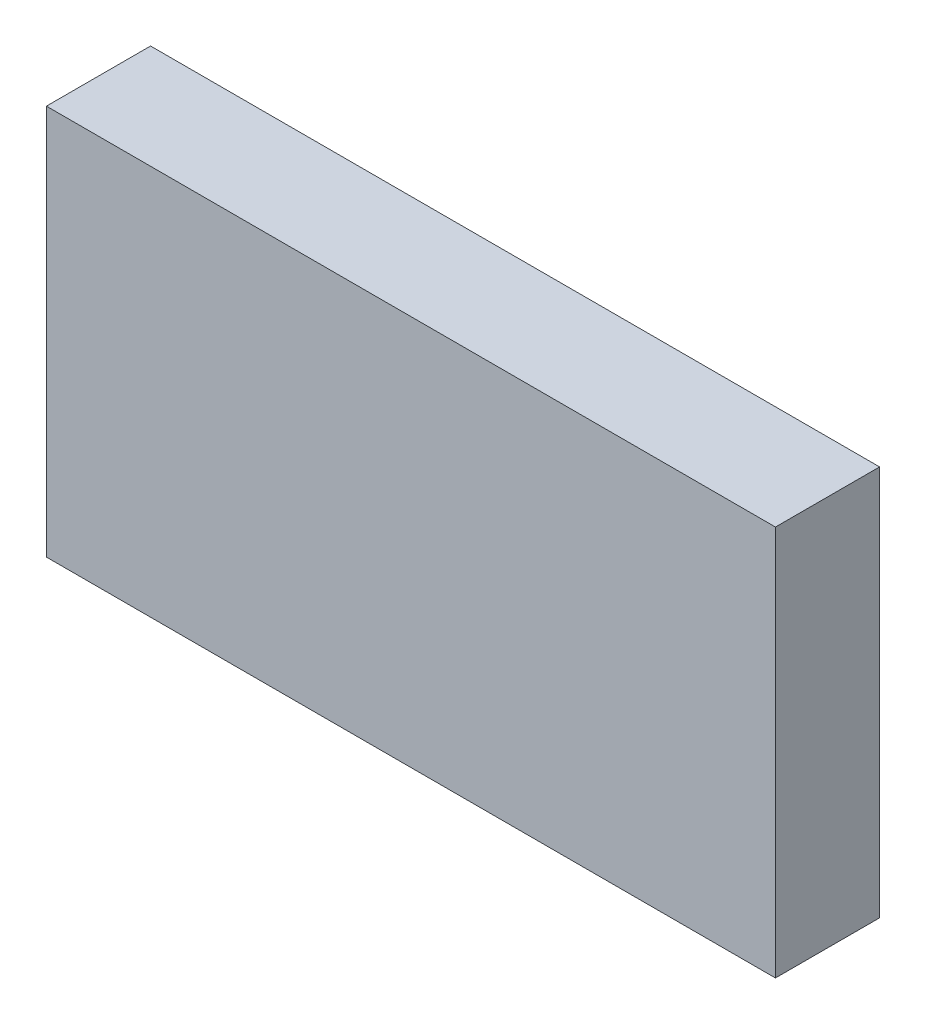
ISO-10303-21;
HEADER;
FILE_DESCRIPTION(('STEP AP214'),'2;1');
FILE_NAME('part.step','',(''),(''),'','','');
FILE_SCHEMA(('AUTOMOTIVE_DESIGN { 1 0 10303 214 1 1 1 1 }'));
ENDSEC;
DATA;
#1=APPLICATION_CONTEXT('core data for automotive mechanical design processes');
#2=APPLICATION_PROTOCOL_DEFINITION('international standard','automotive_design',2000,#1);
#3=PRODUCT_CONTEXT('',#1,'mechanical');
#4=PRODUCT('Part','Part','',(#3));
#5=PRODUCT_RELATED_PRODUCT_CATEGORY('part','',(#4));
#6=PRODUCT_DEFINITION_FORMATION('','',#4);
#7=PRODUCT_DEFINITION_CONTEXT('part definition',#1,'design');
#8=PRODUCT_DEFINITION('design','',#6,#7);
#9=PRODUCT_DEFINITION_SHAPE('','',#8);
#10=(LENGTH_UNIT() NAMED_UNIT(*) SI_UNIT(.MILLI.,.METRE.));
#11=(NAMED_UNIT(*) PLANE_ANGLE_UNIT() SI_UNIT($,.RADIAN.));
#12=(NAMED_UNIT(*) SI_UNIT($,.STERADIAN.) SOLID_ANGLE_UNIT());
#13=UNCERTAINTY_MEASURE_WITH_UNIT(LENGTH_MEASURE(1.E-05),#10,'distance_accuracy_value','');
#14=(GEOMETRIC_REPRESENTATION_CONTEXT(3) GLOBAL_UNCERTAINTY_ASSIGNED_CONTEXT((#13)) GLOBAL_UNIT_ASSIGNED_CONTEXT((#10,
#11,#12)) REPRESENTATION_CONTEXT('',''));
#15=CARTESIAN_POINT('',(0.,0.,0.));
#16=DIRECTION('',(0.,0.,1.));
#17=DIRECTION('',(1.,0.,0.));
#18=AXIS2_PLACEMENT_3D('',#15,#16,#17);
#19=CARTESIAN_POINT('',(0.104909158135323,-0.738316509343394,0.0826433070866142));
#20=DIRECTION('',(0.,0.,-1.));
#21=DIRECTION('',(0.,1.,0.));
#22=AXIS2_PLACEMENT_3D('',#19,#20,#21);
#23=PLANE('',#22);
#24=DIRECTION('',(0.,1.,0.));
#25=VECTOR('',#24,1.);
#26=CARTESIAN_POINT('',(0.108436717190441,-0.738316509343394,0.0826433070866142));
#27=LINE('',#26,#25);
#28=CARTESIAN_POINT('',(0.108436717190441,-0.698631469973316,0.0826433070866142));
#29=VERTEX_POINT('',#28);
#30=CARTESIAN_POINT('',(0.108436717190441,-0.736426745563867,0.0826433070866142));
#31=VERTEX_POINT('',#30);
#32=EDGE_CURVE('E71',#29,#31,#27,.F.);
#33=ORIENTED_EDGE('',*,*,#32,.T.);
#34=DIRECTION('',(1.,0.,0.));
#35=VECTOR('',#34,1.);
#36=CARTESIAN_POINT('',(0.182515457347921,-0.736426745563867,0.0826433070866142));
#37=LINE('',#36,#35);
#38=CARTESIAN_POINT('',(0.178987898292803,-0.736426745563867,0.0826433070866142));
#39=VERTEX_POINT('',#38);
#40=EDGE_CURVE('E54',#39,#31,#37,.F.);
#41=ORIENTED_EDGE('',*,*,#40,.F.);
#42=DIRECTION('',(0.,1.,0.));
#43=VECTOR('',#42,1.);
#44=CARTESIAN_POINT('',(0.178987898292803,-0.738316509343394,0.0826433070866142));
#45=LINE('',#44,#43);
#46=CARTESIAN_POINT('',(0.178987898292803,-0.698631469973316,0.0826433070866142));
#47=VERTEX_POINT('',#46);
#48=EDGE_CURVE('E20',#47,#39,#45,.F.);
#49=ORIENTED_EDGE('',*,*,#48,.F.);
#50=DIRECTION('',(1.,0.,0.));
#51=VECTOR('',#50,1.);
#52=CARTESIAN_POINT('',(0.182515457347921,-0.698631469973316,0.0826433070866142));
#53=LINE('',#52,#51);
#54=EDGE_CURVE('E81',#29,#47,#53,.T.);
#55=ORIENTED_EDGE('',*,*,#54,.F.);
#56=EDGE_LOOP('',(#33,#41,#49,#55));
#57=FACE_BOUND('',#56,.T.);
#58=ADVANCED_FACE('F17',(#57),#23,.F.);
#59=CARTESIAN_POINT('',(0.178987898292803,-0.738316509343394,0.0720606299212598));
#60=DIRECTION('',(-1.,0.,0.));
#61=DIRECTION('',(0.,0.,1.));
#62=AXIS2_PLACEMENT_3D('',#59,#60,#61);
#63=PLANE('',#62);
#64=DIRECTION('',(0.,0.,-1.));
#65=VECTOR('',#64,1.);
#66=CARTESIAN_POINT('',(0.178987898292803,-0.698631469973316,0.0831472440944882));
#67=LINE('',#66,#65);
#68=CARTESIAN_POINT('',(0.178987898292803,-0.698631469973316,0.0725645669291339));
#69=VERTEX_POINT('',#68);
#70=EDGE_CURVE('E64',#47,#69,#67,.T.);
#71=ORIENTED_EDGE('',*,*,#70,.F.);
#72=ORIENTED_EDGE('',*,*,#48,.T.);
#73=DIRECTION('',(0.,0.,1.));
#74=VECTOR('',#73,1.);
#75=CARTESIAN_POINT('',(0.178987898292803,-0.736426745563867,0.0720606299212598));
#76=LINE('',#75,#74);
#77=CARTESIAN_POINT('',(0.178987898292803,-0.736426745563867,0.0725645669291339));
#78=VERTEX_POINT('',#77);
#79=EDGE_CURVE('E62',#78,#39,#76,.T.);
#80=ORIENTED_EDGE('',*,*,#79,.F.);
#81=DIRECTION('',(0.,-1.,0.));
#82=VECTOR('',#81,1.);
#83=CARTESIAN_POINT('',(0.178987898292803,-0.738316509343394,0.0725645669291339));
#84=LINE('',#83,#82);
#85=EDGE_CURVE('E83',#69,#78,#84,.T.);
#86=ORIENTED_EDGE('',*,*,#85,.F.);
#87=EDGE_LOOP('',(#71,#72,#80,#86));
#88=FACE_BOUND('',#87,.T.);
#89=ADVANCED_FACE('F60',(#88),#63,.F.);
#90=CARTESIAN_POINT('',(0.182515457347921,-0.736426745563867,0.0720606299212598));
#91=DIRECTION('',(0.,1.,0.));
#92=DIRECTION('',(0.,0.,1.));
#93=AXIS2_PLACEMENT_3D('',#90,#91,#92);
#94=PLANE('',#93);
#95=DIRECTION('',(0.,0.,1.));
#96=VECTOR('',#95,1.);
#97=CARTESIAN_POINT('',(0.108436717190441,-0.736426745563867,0.0720606299212598));
#98=LINE('',#97,#96);
#99=CARTESIAN_POINT('',(0.108436717190441,-0.736426745563867,0.0725645669291339));
#100=VERTEX_POINT('',#99);
#101=EDGE_CURVE('E73',#31,#100,#98,.F.);
#102=ORIENTED_EDGE('',*,*,#101,.T.);
#103=DIRECTION('',(1.,0.,0.));
#104=VECTOR('',#103,1.);
#105=CARTESIAN_POINT('',(0.182515457347921,-0.736426745563867,0.0725645669291339));
#106=LINE('',#105,#104);
#107=EDGE_CURVE('E69',#78,#100,#106,.F.);
#108=ORIENTED_EDGE('',*,*,#107,.F.);
#109=ORIENTED_EDGE('',*,*,#79,.T.);
#110=ORIENTED_EDGE('',*,*,#40,.T.);
#111=EDGE_LOOP('',(#102,#108,#109,#110));
#112=FACE_BOUND('',#111,.T.);
#113=ADVANCED_FACE('F68',(#112),#94,.F.);
#114=CARTESIAN_POINT('',(0.108436717190441,-0.738316509343394,0.0720606299212598));
#115=DIRECTION('',(-1.,0.,0.));
#116=DIRECTION('',(0.,0.,1.));
#117=AXIS2_PLACEMENT_3D('',#114,#115,#116);
#118=PLANE('',#117);
#119=ORIENTED_EDGE('',*,*,#32,.F.);
#120=DIRECTION('',(0.,0.,-1.));
#121=VECTOR('',#120,1.);
#122=CARTESIAN_POINT('',(0.108436717190441,-0.698631469973316,0.0831472440944882));
#123=LINE('',#122,#121);
#124=CARTESIAN_POINT('',(0.108436717190441,-0.698631469973316,0.0725645669291339));
#125=VERTEX_POINT('',#124);
#126=EDGE_CURVE('E78',#125,#29,#123,.F.);
#127=ORIENTED_EDGE('',*,*,#126,.F.);
#128=DIRECTION('',(0.,-1.,0.));
#129=VECTOR('',#128,1.);
#130=CARTESIAN_POINT('',(0.108436717190441,-0.738316509343394,0.0725645669291339));
#131=LINE('',#130,#129);
#132=EDGE_CURVE('E26',#100,#125,#131,.F.);
#133=ORIENTED_EDGE('',*,*,#132,.F.);
#134=ORIENTED_EDGE('',*,*,#101,.F.);
#135=EDGE_LOOP('',(#119,#127,#133,#134));
#136=FACE_BOUND('',#135,.T.);
#137=ADVANCED_FACE('F88',(#136),#118,.T.);
#138=CARTESIAN_POINT('',(0.182515457347921,-0.698631469973316,0.0831472440944882));
#139=DIRECTION('',(0.,-1.,0.));
#140=DIRECTION('',(0.,0.,-1.));
#141=AXIS2_PLACEMENT_3D('',#138,#139,#140);
#142=PLANE('',#141);
#143=ORIENTED_EDGE('',*,*,#126,.T.);
#144=ORIENTED_EDGE('',*,*,#54,.T.);
#145=ORIENTED_EDGE('',*,*,#70,.T.);
#146=DIRECTION('',(1.,0.,0.));
#147=VECTOR('',#146,1.);
#148=CARTESIAN_POINT('',(0.182515457347921,-0.698631469973316,0.0725645669291339));
#149=LINE('',#148,#147);
#150=EDGE_CURVE('E11',#125,#69,#149,.T.);
#151=ORIENTED_EDGE('',*,*,#150,.F.);
#152=EDGE_LOOP('',(#143,#144,#145,#151));
#153=FACE_BOUND('',#152,.T.);
#154=ADVANCED_FACE('F91',(#153),#142,.F.);
#155=CARTESIAN_POINT('',(0.182515457347921,-0.738316509343394,0.0725645669291339));
#156=DIRECTION('',(0.,0.,1.));
#157=DIRECTION('',(0.,-1.,0.));
#158=AXIS2_PLACEMENT_3D('',#155,#156,#157);
#159=PLANE('',#158);
#160=ORIENTED_EDGE('',*,*,#132,.T.);
#161=ORIENTED_EDGE('',*,*,#150,.T.);
#162=ORIENTED_EDGE('',*,*,#85,.T.);
#163=ORIENTED_EDGE('',*,*,#107,.T.);
#164=EDGE_LOOP('',(#160,#161,#162,#163));
#165=FACE_BOUND('',#164,.T.);
#166=ADVANCED_FACE('F86',(#165),#159,.F.);
#167=CLOSED_SHELL('',(#58,#89,#113,#137,#154,#166));
#168=MANIFOLD_SOLID_BREP('B1',#167);
#169=ADVANCED_BREP_SHAPE_REPRESENTATION('',(#18,#168),#14);
#170=SHAPE_DEFINITION_REPRESENTATION(#9,#169);
ENDSEC;
END-ISO-10303-21;
